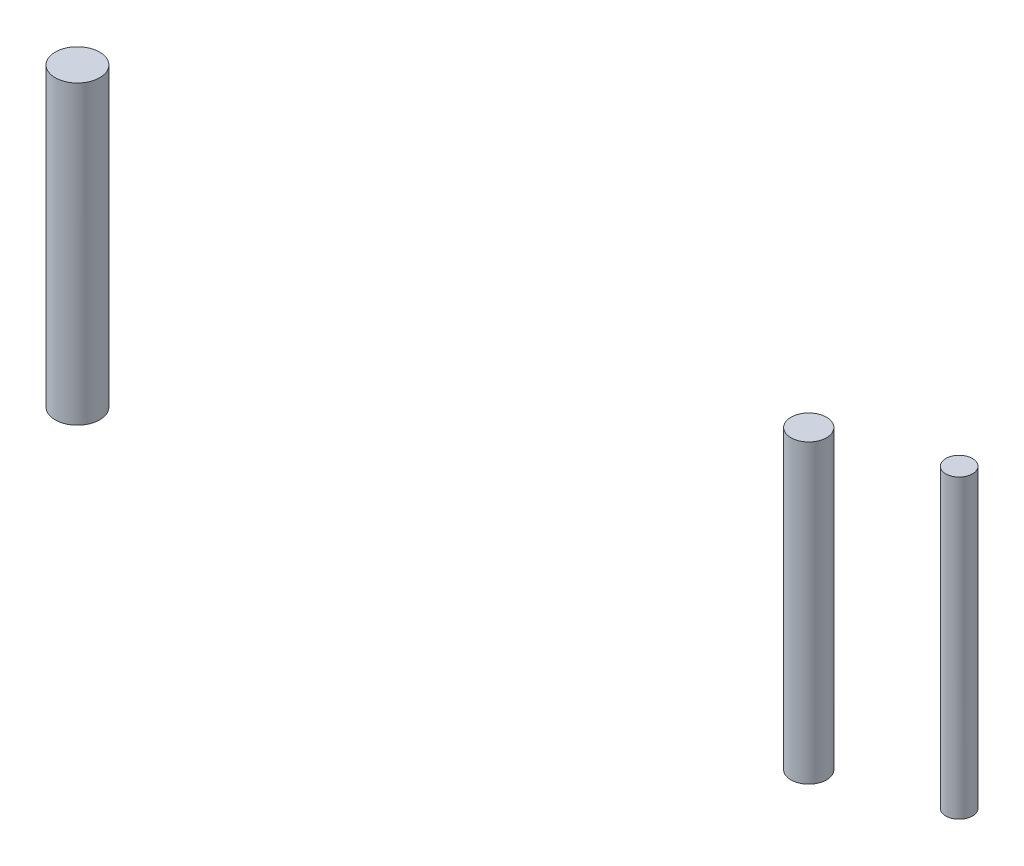
ISO-10303-21;
HEADER;
FILE_DESCRIPTION(('STEP AP214'),'2;1');
FILE_NAME('part.step','',(''),(''),'','','');
FILE_SCHEMA(('AUTOMOTIVE_DESIGN { 1 0 10303 214 1 1 1 1 }'));
ENDSEC;
DATA;
#1=APPLICATION_CONTEXT('core data for automotive mechanical design processes');
#2=APPLICATION_PROTOCOL_DEFINITION('international standard','automotive_design',2000,#1);
#3=PRODUCT_CONTEXT('',#1,'mechanical');
#4=PRODUCT('Part','Part','',(#3));
#5=PRODUCT_RELATED_PRODUCT_CATEGORY('part','',(#4));
#6=PRODUCT_DEFINITION_FORMATION('','',#4);
#7=PRODUCT_DEFINITION_CONTEXT('part definition',#1,'design');
#8=PRODUCT_DEFINITION('design','',#6,#7);
#9=PRODUCT_DEFINITION_SHAPE('','',#8);
#10=(LENGTH_UNIT() NAMED_UNIT(*) SI_UNIT(.MILLI.,.METRE.));
#11=(NAMED_UNIT(*) PLANE_ANGLE_UNIT() SI_UNIT($,.RADIAN.));
#12=(NAMED_UNIT(*) SI_UNIT($,.STERADIAN.) SOLID_ANGLE_UNIT());
#13=UNCERTAINTY_MEASURE_WITH_UNIT(LENGTH_MEASURE(1.E-05),#10,'distance_accuracy_value','');
#14=(GEOMETRIC_REPRESENTATION_CONTEXT(3) GLOBAL_UNCERTAINTY_ASSIGNED_CONTEXT((#13)) GLOBAL_UNIT_ASSIGNED_CONTEXT((#10,
#11,#12)) REPRESENTATION_CONTEXT('',''));
#15=CARTESIAN_POINT('',(0.,0.,0.));
#16=DIRECTION('',(0.,0.,1.));
#17=DIRECTION('',(1.,0.,0.));
#18=AXIS2_PLACEMENT_3D('',#15,#16,#17);
#19=CARTESIAN_POINT('',(465.,-210.6,59.5));
#20=DIRECTION('',(0.,-1.,0.));
#21=DIRECTION('',(0.,0.,-1.));
#22=AXIS2_PLACEMENT_3D('',#19,#20,#21);
#23=PLANE('',#22);
#24=CARTESIAN_POINT('',(465.,-210.6,59.5));
#25=DIRECTION('',(0.,-1.,0.));
#26=DIRECTION('',(0.,0.,1.));
#27=AXIS2_PLACEMENT_3D('',#24,#25,#26);
#28=CIRCLE('',#27,4.5);
#29=CARTESIAN_POINT('',(465.,-210.6,64.));
#30=VERTEX_POINT('',#29);
#31=EDGE_CURVE('E28',#30,#30,#28,.T.);
#32=ORIENTED_EDGE('',*,*,#31,.T.);
#33=EDGE_LOOP('',(#32));
#34=FACE_BOUND('',#33,.T.);
#35=ADVANCED_FACE('F64',(#34),#23,.T.);
#36=CARTESIAN_POINT('',(465.,-110.6,59.5));
#37=DIRECTION('',(0.,-1.,0.));
#38=DIRECTION('',(1.,0.,0.));
#39=AXIS2_PLACEMENT_3D('',#36,#37,#38);
#40=CYLINDRICAL_SURFACE('',#39,4.5);
#41=CARTESIAN_POINT('',(465.,-110.6,59.5));
#42=DIRECTION('',(0.,-1.,0.));
#43=DIRECTION('',(0.,0.,-1.));
#44=AXIS2_PLACEMENT_3D('',#41,#42,#43);
#45=CIRCLE('',#44,4.5);
#46=CARTESIAN_POINT('',(465.,-110.6,55.));
#47=VERTEX_POINT('',#46);
#48=EDGE_CURVE('E30',#47,#47,#45,.F.);
#49=ORIENTED_EDGE('',*,*,#48,.F.);
#50=EDGE_LOOP('',(#49));
#51=FACE_BOUND('',#50,.T.);
#52=ORIENTED_EDGE('',*,*,#31,.F.);
#53=EDGE_LOOP('',(#52));
#54=FACE_BOUND('',#53,.T.);
#55=ADVANCED_FACE('F76',(#51,#54),#40,.T.);
#56=CARTESIAN_POINT('',(0.,-110.6,0.));
#57=DIRECTION('',(0.,-1.,0.));
#58=DIRECTION('',(0.,0.,-1.));
#59=AXIS2_PLACEMENT_3D('',#56,#57,#58);
#60=PLANE('',#59);
#61=ORIENTED_EDGE('',*,*,#48,.T.);
#62=EDGE_LOOP('',(#61));
#63=FACE_BOUND('',#62,.T.);
#64=ADVANCED_FACE('F78',(#63),#60,.F.);
#65=CLOSED_SHELL('',(#35,#55,#64));
#66=MANIFOLD_SOLID_BREP('B1',#65);
#67=CARTESIAN_POINT('',(413.25,-225.67,58.5));
#68=DIRECTION('',(0.,-1.,0.));
#69=DIRECTION('',(0.,0.,-1.));
#70=AXIS2_PLACEMENT_3D('',#67,#68,#69);
#71=PLANE('',#70);
#72=CARTESIAN_POINT('',(413.25,-225.67,58.5));
#73=DIRECTION('',(0.,-1.,0.));
#74=DIRECTION('',(0.,0.,1.));
#75=AXIS2_PLACEMENT_3D('',#72,#73,#74);
#76=CIRCLE('',#75,6.);
#77=CARTESIAN_POINT('',(413.25,-225.67,64.5));
#78=VERTEX_POINT('',#77);
#79=EDGE_CURVE('E19',#78,#78,#76,.T.);
#80=ORIENTED_EDGE('',*,*,#79,.T.);
#81=EDGE_LOOP('',(#80));
#82=FACE_BOUND('',#81,.T.);
#83=ADVANCED_FACE('F63',(#82),#71,.T.);
#84=CARTESIAN_POINT('',(413.25,-125.67,58.5));
#85=DIRECTION('',(0.,-1.,0.));
#86=DIRECTION('',(1.,0.,0.));
#87=AXIS2_PLACEMENT_3D('',#84,#85,#86);
#88=CYLINDRICAL_SURFACE('',#87,6.);
#89=CARTESIAN_POINT('',(413.25,-125.67,58.5));
#90=DIRECTION('',(0.,-1.,0.));
#91=DIRECTION('',(0.,0.,-1.));
#92=AXIS2_PLACEMENT_3D('',#89,#90,#91);
#93=CIRCLE('',#92,6.);
#94=CARTESIAN_POINT('',(413.25,-125.67,52.5));
#95=VERTEX_POINT('',#94);
#96=EDGE_CURVE('E36',#95,#95,#93,.F.);
#97=ORIENTED_EDGE('',*,*,#96,.F.);
#98=EDGE_LOOP('',(#97));
#99=FACE_BOUND('',#98,.T.);
#100=ORIENTED_EDGE('',*,*,#79,.F.);
#101=EDGE_LOOP('',(#100));
#102=FACE_BOUND('',#101,.T.);
#103=ADVANCED_FACE('F17',(#99,#102),#88,.T.);
#104=CARTESIAN_POINT('',(413.25,-125.67,58.5));
#105=DIRECTION('',(0.,-1.,0.));
#106=DIRECTION('',(0.,0.,-1.));
#107=AXIS2_PLACEMENT_3D('',#104,#105,#106);
#108=PLANE('',#107);
#109=ORIENTED_EDGE('',*,*,#96,.T.);
#110=EDGE_LOOP('',(#109));
#111=FACE_BOUND('',#110,.T.);
#112=ADVANCED_FACE('F72',(#111),#108,.F.);
#113=CLOSED_SHELL('',(#83,#103,#112));
#114=MANIFOLD_SOLID_BREP('B1',#113);
#115=CARTESIAN_POINT('',(173.,-236.6,65.));
#116=DIRECTION('',(0.,-1.,0.));
#117=DIRECTION('',(0.,0.,-1.));
#118=AXIS2_PLACEMENT_3D('',#115,#116,#117);
#119=PLANE('',#118);
#120=CARTESIAN_POINT('',(173.,-236.6,65.));
#121=DIRECTION('',(0.,-1.,0.));
#122=DIRECTION('',(0.,0.,1.));
#123=AXIS2_PLACEMENT_3D('',#120,#121,#122);
#124=CIRCLE('',#123,7.5);
#125=CARTESIAN_POINT('',(173.,-236.6,72.5));
#126=VERTEX_POINT('',#125);
#127=EDGE_CURVE('E10',#126,#126,#124,.T.);
#128=ORIENTED_EDGE('',*,*,#127,.T.);
#129=EDGE_LOOP('',(#128));
#130=FACE_BOUND('',#129,.T.);
#131=ADVANCED_FACE('F15',(#130),#119,.T.);
#132=CARTESIAN_POINT('',(173.,-136.6,65.));
#133=DIRECTION('',(0.,-1.,0.));
#134=DIRECTION('',(1.,0.,0.));
#135=AXIS2_PLACEMENT_3D('',#132,#133,#134);
#136=CYLINDRICAL_SURFACE('',#135,7.5);
#137=CARTESIAN_POINT('',(173.,-136.6,65.));
#138=DIRECTION('',(0.,-1.,0.));
#139=DIRECTION('',(0.,0.,-1.));
#140=AXIS2_PLACEMENT_3D('',#137,#138,#139);
#141=CIRCLE('',#140,7.5);
#142=CARTESIAN_POINT('',(173.,-136.6,57.5));
#143=VERTEX_POINT('',#142);
#144=EDGE_CURVE('E40',#143,#143,#141,.F.);
#145=ORIENTED_EDGE('',*,*,#144,.F.);
#146=EDGE_LOOP('',(#145));
#147=FACE_BOUND('',#146,.T.);
#148=ORIENTED_EDGE('',*,*,#127,.F.);
#149=EDGE_LOOP('',(#148));
#150=FACE_BOUND('',#149,.T.);
#151=ADVANCED_FACE('F49',(#147,#150),#136,.T.);
#152=CARTESIAN_POINT('',(173.,-136.6,65.));
#153=DIRECTION('',(0.,-1.,0.));
#154=DIRECTION('',(0.,0.,-1.));
#155=AXIS2_PLACEMENT_3D('',#152,#153,#154);
#156=PLANE('',#155);
#157=ORIENTED_EDGE('',*,*,#144,.T.);
#158=EDGE_LOOP('',(#157));
#159=FACE_BOUND('',#158,.T.);
#160=ADVANCED_FACE('F47',(#159),#156,.F.);
#161=CLOSED_SHELL('',(#131,#151,#160));
#162=MANIFOLD_SOLID_BREP('B1',#161);
#163=ADVANCED_BREP_SHAPE_REPRESENTATION('',(#18,#66,#114,#162),#14);
#164=SHAPE_DEFINITION_REPRESENTATION(#9,#163);
ENDSEC;
END-ISO-10303-21;
